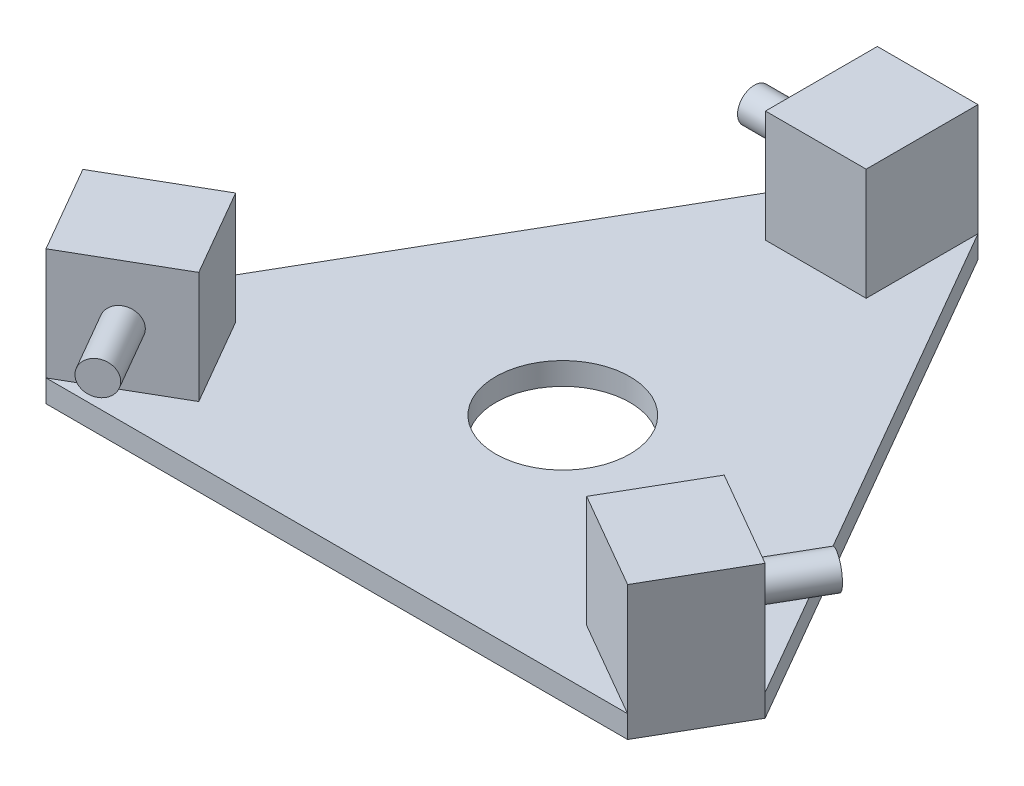
ISO-10303-21;
HEADER;
FILE_DESCRIPTION(('STEP AP214'),'2;1');
FILE_NAME('part.step','',(''),(''),'','','');
FILE_SCHEMA(('AUTOMOTIVE_DESIGN { 1 0 10303 214 1 1 1 1 }'));
ENDSEC;
DATA;
#1=APPLICATION_CONTEXT('core data for automotive mechanical design processes');
#2=APPLICATION_PROTOCOL_DEFINITION('international standard','automotive_design',2000,#1);
#3=PRODUCT_CONTEXT('',#1,'mechanical');
#4=PRODUCT('Part','Part','',(#3));
#5=PRODUCT_RELATED_PRODUCT_CATEGORY('part','',(#4));
#6=PRODUCT_DEFINITION_FORMATION('','',#4);
#7=PRODUCT_DEFINITION_CONTEXT('part definition',#1,'design');
#8=PRODUCT_DEFINITION('design','',#6,#7);
#9=PRODUCT_DEFINITION_SHAPE('','',#8);
#10=(LENGTH_UNIT() NAMED_UNIT(*) SI_UNIT(.MILLI.,.METRE.));
#11=(NAMED_UNIT(*) PLANE_ANGLE_UNIT() SI_UNIT($,.RADIAN.));
#12=(NAMED_UNIT(*) SI_UNIT($,.STERADIAN.) SOLID_ANGLE_UNIT());
#13=UNCERTAINTY_MEASURE_WITH_UNIT(LENGTH_MEASURE(1.E-05),#10,'distance_accuracy_value','');
#14=(GEOMETRIC_REPRESENTATION_CONTEXT(3) GLOBAL_UNCERTAINTY_ASSIGNED_CONTEXT((#13)) GLOBAL_UNIT_ASSIGNED_CONTEXT((#10,
#11,#12)) REPRESENTATION_CONTEXT('',''));
#15=CARTESIAN_POINT('',(0.,0.,0.));
#16=DIRECTION('',(0.,0.,1.));
#17=DIRECTION('',(1.,0.,0.));
#18=AXIS2_PLACEMENT_3D('',#15,#16,#17);
#19=CARTESIAN_POINT('',(0.,10.,0.));
#20=DIRECTION('',(0.,1.,0.));
#21=DIRECTION('',(0.,0.,1.));
#22=AXIS2_PLACEMENT_3D('',#19,#20,#21);
#23=PLANE('',#22);
#24=CARTESIAN_POINT('',(0.,10.,0.));
#25=DIRECTION('',(0.,1.,0.));
#26=DIRECTION('',(0.,0.,1.));
#27=AXIS2_PLACEMENT_3D('',#24,#25,#26);
#28=CIRCLE('',#27,30.);
#29=CARTESIAN_POINT('',(0.,10.,30.));
#30=VERTEX_POINT('',#29);
#31=EDGE_CURVE('E240',#30,#30,#28,.T.);
#32=ORIENTED_EDGE('',*,*,#31,.F.);
#33=EDGE_LOOP('',(#32));
#34=FACE_BOUND('',#33,.T.);
#35=DIRECTION('',(1.,0.,0.));
#36=VECTOR('',#35,1.);
#37=CARTESIAN_POINT('',(-130.,10.,101.036297108185));
#38=LINE('',#37,#36);
#39=CARTESIAN_POINT('',(-130.,10.,101.036297108185));
#40=VERTEX_POINT('',#39);
#41=CARTESIAN_POINT('',(130.,10.,101.036297108185));
#42=VERTEX_POINT('',#41);
#43=EDGE_CURVE('E248',#40,#42,#38,.T.);
#44=ORIENTED_EDGE('',*,*,#43,.T.);
#45=DIRECTION('',(0.866025403784439,0.,0.5));
#46=VECTOR('',#45,1.);
#47=CARTESIAN_POINT('',(86.698729810778,10.,76.0362971081845));
#48=LINE('',#47,#46);
#49=CARTESIAN_POINT('',(86.698729810778,10.,76.0362971081845));
#50=VERTEX_POINT('',#49);
#51=EDGE_CURVE('E61',#50,#42,#48,.T.);
#52=ORIENTED_EDGE('',*,*,#51,.F.);
#53=DIRECTION('',(-0.5,0.,0.866025403784439));
#54=VECTOR('',#53,1.);
#55=CARTESIAN_POINT('',(86.698729810778,10.,76.0362971081845));
#56=LINE('',#55,#54);
#57=CARTESIAN_POINT('',(109.198729810778,10.,37.0651539378848));
#58=VERTEX_POINT('',#57);
#59=EDGE_CURVE('E66',#58,#50,#56,.T.);
#60=ORIENTED_EDGE('',*,*,#59,.F.);
#61=DIRECTION('',(-0.866025403784439,0.,-0.5));
#62=VECTOR('',#61,1.);
#63=CARTESIAN_POINT('',(109.198729810778,10.,37.0651539378848));
#64=LINE('',#63,#62);
#65=CARTESIAN_POINT('',(152.5,10.,62.0651539378848));
#66=VERTEX_POINT('',#65);
#67=EDGE_CURVE('E171',#66,#58,#64,.T.);
#68=ORIENTED_EDGE('',*,*,#67,.F.);
#69=DIRECTION('',(-0.5,0.,-0.866025403784439));
#70=VECTOR('',#69,1.);
#71=CARTESIAN_POINT('',(152.5,10.,62.0651539378848));
#72=LINE('',#71,#70);
#73=CARTESIAN_POINT('',(22.5,10.,-163.101451046069));
#74=VERTEX_POINT('',#73);
#75=EDGE_CURVE('E251',#66,#74,#72,.T.);
#76=ORIENTED_EDGE('',*,*,#75,.T.);
#77=DIRECTION('',(0.,0.,-1.));
#78=VECTOR('',#77,1.);
#79=CARTESIAN_POINT('',(22.5,10.,-113.101451046069));
#80=LINE('',#79,#78);
#81=CARTESIAN_POINT('',(22.5,10.,-113.101451046069));
#82=VERTEX_POINT('',#81);
#83=EDGE_CURVE('E223',#82,#74,#80,.T.);
#84=ORIENTED_EDGE('',*,*,#83,.F.);
#85=DIRECTION('',(1.,0.,0.));
#86=VECTOR('',#85,1.);
#87=CARTESIAN_POINT('',(-22.5,10.,-113.101451046069));
#88=LINE('',#87,#86);
#89=CARTESIAN_POINT('',(-22.5,10.,-113.101451046069));
#90=VERTEX_POINT('',#89);
#91=EDGE_CURVE('E209',#90,#82,#88,.T.);
#92=ORIENTED_EDGE('',*,*,#91,.F.);
#93=DIRECTION('',(0.,0.,1.));
#94=VECTOR('',#93,1.);
#95=CARTESIAN_POINT('',(-22.5,10.,-113.101451046069));
#96=LINE('',#95,#94);
#97=CARTESIAN_POINT('',(-22.5,10.,-163.101451046069));
#98=VERTEX_POINT('',#97);
#99=EDGE_CURVE('E214',#98,#90,#96,.T.);
#100=ORIENTED_EDGE('',*,*,#99,.F.);
#101=DIRECTION('',(-0.5,0.,0.866025403784439));
#102=VECTOR('',#101,1.);
#103=CARTESIAN_POINT('',(-22.5,10.,-163.101451046069));
#104=LINE('',#103,#102);
#105=CARTESIAN_POINT('',(-152.5,10.,62.0651539378848));
#106=VERTEX_POINT('',#105);
#107=EDGE_CURVE('E246',#98,#106,#104,.T.);
#108=ORIENTED_EDGE('',*,*,#107,.T.);
#109=DIRECTION('',(-0.866025403784438,0.,0.500000000000001));
#110=VECTOR('',#109,1.);
#111=CARTESIAN_POINT('',(-109.198729810778,10.,37.0651539378848));
#112=LINE('',#111,#110);
#113=CARTESIAN_POINT('',(-109.198729810778,10.,37.0651539378848));
#114=VERTEX_POINT('',#113);
#115=EDGE_CURVE('E177',#114,#106,#112,.T.);
#116=ORIENTED_EDGE('',*,*,#115,.F.);
#117=DIRECTION('',(-0.500000000000001,0.,-0.866025403784438));
#118=VECTOR('',#117,1.);
#119=CARTESIAN_POINT('',(-86.6987298107781,10.,76.0362971081845));
#120=LINE('',#119,#118);
#121=CARTESIAN_POINT('',(-86.6987298107781,10.,76.0362971081845));
#122=VERTEX_POINT('',#121);
#123=EDGE_CURVE('E174',#122,#114,#120,.T.);
#124=ORIENTED_EDGE('',*,*,#123,.F.);
#125=DIRECTION('',(0.866025403784438,0.,-0.500000000000001));
#126=VECTOR('',#125,1.);
#127=CARTESIAN_POINT('',(-86.6987298107781,10.,76.0362971081845));
#128=LINE('',#127,#126);
#129=EDGE_CURVE('E187',#40,#122,#128,.T.);
#130=ORIENTED_EDGE('',*,*,#129,.F.);
#131=EDGE_LOOP('',(#44,#52,#60,#68,#76,#84,#92,#100,#108,#116,#124,#130));
#132=FACE_BOUND('',#131,.T.);
#133=ADVANCED_FACE('F46',(#34,#132),#23,.T.);
#134=CARTESIAN_POINT('',(0.,0.,0.));
#135=DIRECTION('',(0.,1.,0.));
#136=DIRECTION('',(0.,0.,1.));
#137=AXIS2_PLACEMENT_3D('',#134,#135,#136);
#138=PLANE('',#137);
#139=DIRECTION('',(-0.5,0.,0.866025403784439));
#140=VECTOR('',#139,1.);
#141=CARTESIAN_POINT('',(-22.5,0.,-163.101451046069));
#142=LINE('',#141,#140);
#143=CARTESIAN_POINT('',(-22.5,0.,-163.101451046069));
#144=VERTEX_POINT('',#143);
#145=CARTESIAN_POINT('',(-152.5,0.,62.0651539378848));
#146=VERTEX_POINT('',#145);
#147=EDGE_CURVE('E243',#144,#146,#142,.T.);
#148=ORIENTED_EDGE('',*,*,#147,.F.);
#149=DIRECTION('',(-1.,0.,0.));
#150=VECTOR('',#149,1.);
#151=CARTESIAN_POINT('',(22.5,0.,-163.101451046069));
#152=LINE('',#151,#150);
#153=CARTESIAN_POINT('',(22.5,0.,-163.101451046069));
#154=VERTEX_POINT('',#153);
#155=EDGE_CURVE('E249',#154,#144,#152,.T.);
#156=ORIENTED_EDGE('',*,*,#155,.F.);
#157=DIRECTION('',(-0.5,0.,-0.866025403784439));
#158=VECTOR('',#157,1.);
#159=CARTESIAN_POINT('',(152.5,0.,62.0651539378848));
#160=LINE('',#159,#158);
#161=CARTESIAN_POINT('',(152.5,0.,62.0651539378848));
#162=VERTEX_POINT('',#161);
#163=EDGE_CURVE('E263',#162,#154,#160,.T.);
#164=ORIENTED_EDGE('',*,*,#163,.F.);
#165=DIRECTION('',(0.5,0.,-0.866025403784439));
#166=VECTOR('',#165,1.);
#167=CARTESIAN_POINT('',(130.,0.,101.036297108185));
#168=LINE('',#167,#166);
#169=CARTESIAN_POINT('',(130.,0.,101.036297108185));
#170=VERTEX_POINT('',#169);
#171=EDGE_CURVE('E261',#170,#162,#168,.T.);
#172=ORIENTED_EDGE('',*,*,#171,.F.);
#173=DIRECTION('',(1.,0.,0.));
#174=VECTOR('',#173,1.);
#175=CARTESIAN_POINT('',(-130.,0.,101.036297108185));
#176=LINE('',#175,#174);
#177=CARTESIAN_POINT('',(-130.,0.,101.036297108185));
#178=VERTEX_POINT('',#177);
#179=EDGE_CURVE('E259',#178,#170,#176,.T.);
#180=ORIENTED_EDGE('',*,*,#179,.F.);
#181=DIRECTION('',(0.500000000000001,0.,0.866025403784438));
#182=VECTOR('',#181,1.);
#183=CARTESIAN_POINT('',(-152.5,0.,62.0651539378848));
#184=LINE('',#183,#182);
#185=EDGE_CURVE('E257',#146,#178,#184,.T.);
#186=ORIENTED_EDGE('',*,*,#185,.F.);
#187=EDGE_LOOP('',(#148,#156,#164,#172,#180,#186));
#188=FACE_BOUND('',#187,.T.);
#189=CARTESIAN_POINT('',(0.,0.,0.));
#190=DIRECTION('',(0.,1.,0.));
#191=DIRECTION('',(0.,0.,1.));
#192=AXIS2_PLACEMENT_3D('',#189,#190,#191);
#193=CIRCLE('',#192,30.);
#194=CARTESIAN_POINT('',(0.,0.,30.));
#195=VERTEX_POINT('',#194);
#196=EDGE_CURVE('E239',#195,#195,#193,.T.);
#197=ORIENTED_EDGE('',*,*,#196,.T.);
#198=EDGE_LOOP('',(#197));
#199=FACE_BOUND('',#198,.T.);
#200=ADVANCED_FACE('F288',(#188,#199),#138,.F.);
#201=CARTESIAN_POINT('',(-22.5,10.,-163.101451046069));
#202=DIRECTION('',(0.866025403784439,0.,0.5));
#203=DIRECTION('',(0.5,0.,-0.866025403784439));
#204=AXIS2_PLACEMENT_3D('',#201,#202,#203);
#205=PLANE('',#204);
#206=ORIENTED_EDGE('',*,*,#147,.T.);
#207=DIRECTION('',(0.,-1.,0.));
#208=VECTOR('',#207,1.);
#209=CARTESIAN_POINT('',(-152.5,10.,62.0651539378848));
#210=LINE('',#209,#208);
#211=EDGE_CURVE('E13',#106,#146,#210,.T.);
#212=ORIENTED_EDGE('',*,*,#211,.F.);
#213=ORIENTED_EDGE('',*,*,#107,.F.);
#214=DIRECTION('',(0.,-1.,0.));
#215=VECTOR('',#214,1.);
#216=CARTESIAN_POINT('',(-22.5,10.,-163.101451046069));
#217=LINE('',#216,#215);
#218=EDGE_CURVE('E254',#98,#144,#217,.T.);
#219=ORIENTED_EDGE('',*,*,#218,.T.);
#220=EDGE_LOOP('',(#206,#212,#213,#219));
#221=FACE_BOUND('',#220,.T.);
#222=ADVANCED_FACE('F48',(#221),#205,.F.);
#223=CARTESIAN_POINT('',(-152.5,10.,62.0651539378848));
#224=DIRECTION('',(0.866025403784438,0.,-0.500000000000001));
#225=DIRECTION('',(-0.500000000000001,0.,-0.866025403784438));
#226=AXIS2_PLACEMENT_3D('',#223,#224,#225);
#227=PLANE('',#226);
#228=ORIENTED_EDGE('',*,*,#185,.T.);
#229=DIRECTION('',(0.,-1.,0.));
#230=VECTOR('',#229,1.);
#231=CARTESIAN_POINT('',(-130.,10.,101.036297108185));
#232=LINE('',#231,#230);
#233=EDGE_CURVE('E54',#40,#178,#232,.T.);
#234=ORIENTED_EDGE('',*,*,#233,.F.);
#235=DIRECTION('',(0.,-1.,0.));
#236=VECTOR('',#235,1.);
#237=CARTESIAN_POINT('',(-130.,60.,101.036297108185));
#238=LINE('',#237,#236);
#239=CARTESIAN_POINT('',(-130.,60.,101.036297108185));
#240=VERTEX_POINT('',#239);
#241=EDGE_CURVE('E200',#240,#40,#238,.T.);
#242=ORIENTED_EDGE('',*,*,#241,.F.);
#243=DIRECTION('',(0.500000000000001,0.,0.866025403784438));
#244=VECTOR('',#243,1.);
#245=CARTESIAN_POINT('',(-130.,60.,101.036297108185));
#246=LINE('',#245,#244);
#247=CARTESIAN_POINT('',(-152.5,60.,62.0651539378848));
#248=VERTEX_POINT('',#247);
#249=EDGE_CURVE('E189',#248,#240,#246,.T.);
#250=ORIENTED_EDGE('',*,*,#249,.F.);
#251=DIRECTION('',(0.,-1.,0.));
#252=VECTOR('',#251,1.);
#253=CARTESIAN_POINT('',(-152.5,60.,62.0651539378848));
#254=LINE('',#253,#252);
#255=EDGE_CURVE('E203',#248,#106,#254,.T.);
#256=ORIENTED_EDGE('',*,*,#255,.T.);
#257=ORIENTED_EDGE('',*,*,#211,.T.);
#258=EDGE_LOOP('',(#228,#234,#242,#250,#256,#257));
#259=FACE_BOUND('',#258,.T.);
#260=ADVANCED_FACE('F347',(#259),#227,.F.);
#261=CARTESIAN_POINT('',(-130.,10.,101.036297108185));
#262=DIRECTION('',(0.,0.,-1.));
#263=DIRECTION('',(-1.,0.,0.));
#264=AXIS2_PLACEMENT_3D('',#261,#262,#263);
#265=PLANE('',#264);
#266=ORIENTED_EDGE('',*,*,#179,.T.);
#267=DIRECTION('',(0.,-1.,0.));
#268=VECTOR('',#267,1.);
#269=CARTESIAN_POINT('',(130.,10.,101.036297108185));
#270=LINE('',#269,#268);
#271=EDGE_CURVE('E274',#42,#170,#270,.T.);
#272=ORIENTED_EDGE('',*,*,#271,.F.);
#273=ORIENTED_EDGE('',*,*,#43,.F.);
#274=ORIENTED_EDGE('',*,*,#233,.T.);
#275=EDGE_LOOP('',(#266,#272,#273,#274));
#276=FACE_BOUND('',#275,.T.);
#277=ADVANCED_FACE('F280',(#276),#265,.F.);
#278=CARTESIAN_POINT('',(130.,10.,101.036297108185));
#279=DIRECTION('',(-0.866025403784439,0.,-0.5));
#280=DIRECTION('',(-0.5,0.,0.866025403784439));
#281=AXIS2_PLACEMENT_3D('',#278,#279,#280);
#282=PLANE('',#281);
#283=ORIENTED_EDGE('',*,*,#171,.T.);
#284=DIRECTION('',(0.,-1.,0.));
#285=VECTOR('',#284,1.);
#286=CARTESIAN_POINT('',(152.5,10.,62.0651539378848));
#287=LINE('',#286,#285);
#288=EDGE_CURVE('E271',#66,#162,#287,.T.);
#289=ORIENTED_EDGE('',*,*,#288,.F.);
#290=DIRECTION('',(0.,-1.,0.));
#291=VECTOR('',#290,1.);
#292=CARTESIAN_POINT('',(152.5,60.,62.0651539378848));
#293=LINE('',#292,#291);
#294=CARTESIAN_POINT('',(152.5,60.,62.0651539378848));
#295=VERTEX_POINT('',#294);
#296=EDGE_CURVE('E179',#295,#66,#293,.T.);
#297=ORIENTED_EDGE('',*,*,#296,.F.);
#298=DIRECTION('',(0.5,0.,-0.866025403784439));
#299=VECTOR('',#298,1.);
#300=CARTESIAN_POINT('',(130.,60.,101.036297108185));
#301=LINE('',#300,#299);
#302=CARTESIAN_POINT('',(130.,60.,101.036297108185));
#303=VERTEX_POINT('',#302);
#304=EDGE_CURVE('E161',#303,#295,#301,.T.);
#305=ORIENTED_EDGE('',*,*,#304,.F.);
#306=DIRECTION('',(0.,-1.,0.));
#307=VECTOR('',#306,1.);
#308=CARTESIAN_POINT('',(130.,60.,101.036297108185));
#309=LINE('',#308,#307);
#310=EDGE_CURVE('E158',#303,#42,#309,.T.);
#311=ORIENTED_EDGE('',*,*,#310,.T.);
#312=ORIENTED_EDGE('',*,*,#271,.T.);
#313=EDGE_LOOP('',(#283,#289,#297,#305,#311,#312));
#314=FACE_BOUND('',#313,.T.);
#315=ADVANCED_FACE('F294',(#314),#282,.F.);
#316=CARTESIAN_POINT('',(152.5,10.,62.0651539378848));
#317=DIRECTION('',(-0.866025403784439,0.,0.5));
#318=DIRECTION('',(0.5,0.,0.866025403784439));
#319=AXIS2_PLACEMENT_3D('',#316,#317,#318);
#320=PLANE('',#319);
#321=ORIENTED_EDGE('',*,*,#163,.T.);
#322=DIRECTION('',(0.,-1.,0.));
#323=VECTOR('',#322,1.);
#324=CARTESIAN_POINT('',(22.5,10.,-163.101451046069));
#325=LINE('',#324,#323);
#326=EDGE_CURVE('E268',#74,#154,#325,.T.);
#327=ORIENTED_EDGE('',*,*,#326,.F.);
#328=ORIENTED_EDGE('',*,*,#75,.F.);
#329=ORIENTED_EDGE('',*,*,#288,.T.);
#330=EDGE_LOOP('',(#321,#327,#328,#329));
#331=FACE_BOUND('',#330,.T.);
#332=ADVANCED_FACE('F297',(#331),#320,.F.);
#333=CARTESIAN_POINT('',(22.5,10.,-163.101451046069));
#334=DIRECTION('',(0.,0.,1.));
#335=DIRECTION('',(1.,0.,0.));
#336=AXIS2_PLACEMENT_3D('',#333,#334,#335);
#337=PLANE('',#336);
#338=ORIENTED_EDGE('',*,*,#155,.T.);
#339=ORIENTED_EDGE('',*,*,#218,.F.);
#340=DIRECTION('',(0.,-1.,0.));
#341=VECTOR('',#340,1.);
#342=CARTESIAN_POINT('',(-22.5,60.,-163.101451046069));
#343=LINE('',#342,#341);
#344=CARTESIAN_POINT('',(-22.5,60.,-163.101451046069));
#345=VERTEX_POINT('',#344);
#346=EDGE_CURVE('E230',#345,#98,#343,.T.);
#347=ORIENTED_EDGE('',*,*,#346,.F.);
#348=DIRECTION('',(-1.,0.,0.));
#349=VECTOR('',#348,1.);
#350=CARTESIAN_POINT('',(-22.5,60.,-163.101451046069));
#351=LINE('',#350,#349);
#352=CARTESIAN_POINT('',(22.5,60.,-163.101451046069));
#353=VERTEX_POINT('',#352);
#354=EDGE_CURVE('E216',#353,#345,#351,.T.);
#355=ORIENTED_EDGE('',*,*,#354,.F.);
#356=DIRECTION('',(0.,-1.,0.));
#357=VECTOR('',#356,1.);
#358=CARTESIAN_POINT('',(22.5,60.,-163.101451046069));
#359=LINE('',#358,#357);
#360=EDGE_CURVE('E233',#353,#74,#359,.T.);
#361=ORIENTED_EDGE('',*,*,#360,.T.);
#362=ORIENTED_EDGE('',*,*,#326,.T.);
#363=EDGE_LOOP('',(#338,#339,#347,#355,#361,#362));
#364=FACE_BOUND('',#363,.T.);
#365=ADVANCED_FACE('F305',(#364),#337,.F.);
#366=CARTESIAN_POINT('',(0.,10.,0.));
#367=DIRECTION('',(0.,-1.,0.));
#368=DIRECTION('',(0.,0.,-1.));
#369=AXIS2_PLACEMENT_3D('',#366,#367,#368);
#370=CYLINDRICAL_SURFACE('',#369,30.);
#371=ORIENTED_EDGE('',*,*,#31,.T.);
#372=EDGE_LOOP('',(#371));
#373=FACE_BOUND('',#372,.T.);
#374=ORIENTED_EDGE('',*,*,#196,.F.);
#375=EDGE_LOOP('',(#374));
#376=FACE_BOUND('',#375,.T.);
#377=ADVANCED_FACE('F337',(#373,#376),#370,.F.);
#378=CARTESIAN_POINT('',(-22.5,60.,-113.101451046069));
#379=DIRECTION('',(0.,0.,-1.));
#380=DIRECTION('',(-1.,0.,0.));
#381=AXIS2_PLACEMENT_3D('',#378,#379,#380);
#382=PLANE('',#381);
#383=ORIENTED_EDGE('',*,*,#91,.T.);
#384=DIRECTION('',(0.,-1.,0.));
#385=VECTOR('',#384,1.);
#386=CARTESIAN_POINT('',(22.5,60.,-113.101451046069));
#387=LINE('',#386,#385);
#388=CARTESIAN_POINT('',(22.5,60.,-113.101451046069));
#389=VERTEX_POINT('',#388);
#390=EDGE_CURVE('E236',#389,#82,#387,.T.);
#391=ORIENTED_EDGE('',*,*,#390,.F.);
#392=DIRECTION('',(1.,0.,0.));
#393=VECTOR('',#392,1.);
#394=CARTESIAN_POINT('',(-22.5,60.,-113.101451046069));
#395=LINE('',#394,#393);
#396=CARTESIAN_POINT('',(-22.5,60.,-113.101451046069));
#397=VERTEX_POINT('',#396);
#398=EDGE_CURVE('E210',#397,#389,#395,.T.);
#399=ORIENTED_EDGE('',*,*,#398,.F.);
#400=DIRECTION('',(0.,-1.,0.));
#401=VECTOR('',#400,1.);
#402=CARTESIAN_POINT('',(-22.5,60.,-113.101451046069));
#403=LINE('',#402,#401);
#404=EDGE_CURVE('E220',#397,#90,#403,.T.);
#405=ORIENTED_EDGE('',*,*,#404,.T.);
#406=EDGE_LOOP('',(#383,#391,#399,#405));
#407=FACE_BOUND('',#406,.T.);
#408=ADVANCED_FACE('F314',(#407),#382,.F.);
#409=CARTESIAN_POINT('',(22.5,60.,-113.101451046069));
#410=DIRECTION('',(-1.,0.,0.));
#411=DIRECTION('',(0.,0.,1.));
#412=AXIS2_PLACEMENT_3D('',#409,#410,#411);
#413=PLANE('',#412);
#414=ORIENTED_EDGE('',*,*,#83,.T.);
#415=ORIENTED_EDGE('',*,*,#360,.F.);
#416=DIRECTION('',(0.,0.,-1.));
#417=VECTOR('',#416,1.);
#418=CARTESIAN_POINT('',(22.5,60.,-113.101451046069));
#419=LINE('',#418,#417);
#420=EDGE_CURVE('E213',#389,#353,#419,.T.);
#421=ORIENTED_EDGE('',*,*,#420,.F.);
#422=ORIENTED_EDGE('',*,*,#390,.T.);
#423=EDGE_LOOP('',(#414,#415,#421,#422));
#424=FACE_BOUND('',#423,.T.);
#425=ADVANCED_FACE('F301',(#424),#413,.F.);
#426=CARTESIAN_POINT('',(-22.5,60.,-113.101451046069));
#427=DIRECTION('',(1.,0.,0.));
#428=DIRECTION('',(0.,0.,-1.));
#429=AXIS2_PLACEMENT_3D('',#426,#427,#428);
#430=PLANE('',#429);
#431=CARTESIAN_POINT('',(-22.5,35.,-138.101451046069));
#432=DIRECTION('',(1.,0.,0.));
#433=DIRECTION('',(0.,0.,-1.));
#434=AXIS2_PLACEMENT_3D('',#431,#432,#433);
#435=CIRCLE('',#434,7.49999999999999);
#436=CARTESIAN_POINT('',(-22.5,35.,-145.601451046069));
#437=VERTEX_POINT('',#436);
#438=EDGE_CURVE('E509',#437,#437,#435,.T.);
#439=ORIENTED_EDGE('',*,*,#438,.T.);
#440=EDGE_LOOP('',(#439));
#441=FACE_BOUND('',#440,.T.);
#442=ORIENTED_EDGE('',*,*,#99,.T.);
#443=ORIENTED_EDGE('',*,*,#404,.F.);
#444=DIRECTION('',(0.,0.,1.));
#445=VECTOR('',#444,1.);
#446=CARTESIAN_POINT('',(-22.5,60.,-113.101451046069));
#447=LINE('',#446,#445);
#448=EDGE_CURVE('E218',#345,#397,#447,.T.);
#449=ORIENTED_EDGE('',*,*,#448,.F.);
#450=ORIENTED_EDGE('',*,*,#346,.T.);
#451=EDGE_LOOP('',(#442,#443,#449,#450));
#452=FACE_BOUND('',#451,.T.);
#453=ADVANCED_FACE('F316',(#441,#452),#430,.F.);
#454=CARTESIAN_POINT('',(0.,60.,0.));
#455=DIRECTION('',(0.,1.,0.));
#456=DIRECTION('',(0.,0.,1.));
#457=AXIS2_PLACEMENT_3D('',#454,#455,#456);
#458=PLANE('',#457);
#459=ORIENTED_EDGE('',*,*,#398,.T.);
#460=ORIENTED_EDGE('',*,*,#420,.T.);
#461=ORIENTED_EDGE('',*,*,#354,.T.);
#462=ORIENTED_EDGE('',*,*,#448,.T.);
#463=EDGE_LOOP('',(#459,#460,#461,#462));
#464=FACE_BOUND('',#463,.T.);
#465=ADVANCED_FACE('F310',(#464),#458,.T.);
#466=CARTESIAN_POINT('',(-86.6987298107781,60.,76.0362971081845));
#467=DIRECTION('',(-0.866025403784438,0.,0.500000000000001));
#468=DIRECTION('',(0.500000000000001,0.,0.866025403784438));
#469=AXIS2_PLACEMENT_3D('',#466,#467,#468);
#470=PLANE('',#469);
#471=ORIENTED_EDGE('',*,*,#123,.T.);
#472=DIRECTION('',(0.,-1.,0.));
#473=VECTOR('',#472,1.);
#474=CARTESIAN_POINT('',(-109.198729810778,60.,37.0651539378848));
#475=LINE('',#474,#473);
#476=CARTESIAN_POINT('',(-109.198729810778,60.,37.0651539378848));
#477=VERTEX_POINT('',#476);
#478=EDGE_CURVE('E206',#477,#114,#475,.T.);
#479=ORIENTED_EDGE('',*,*,#478,.F.);
#480=DIRECTION('',(-0.500000000000001,0.,-0.866025403784438));
#481=VECTOR('',#480,1.);
#482=CARTESIAN_POINT('',(-86.6987298107781,60.,76.0362971081845));
#483=LINE('',#482,#481);
#484=CARTESIAN_POINT('',(-86.6987298107781,60.,76.0362971081845));
#485=VERTEX_POINT('',#484);
#486=EDGE_CURVE('E183',#485,#477,#483,.T.);
#487=ORIENTED_EDGE('',*,*,#486,.F.);
#488=DIRECTION('',(0.,-1.,0.));
#489=VECTOR('',#488,1.);
#490=CARTESIAN_POINT('',(-86.6987298107781,60.,76.0362971081845));
#491=LINE('',#490,#489);
#492=EDGE_CURVE('E192',#485,#122,#491,.T.);
#493=ORIENTED_EDGE('',*,*,#492,.T.);
#494=EDGE_LOOP('',(#471,#479,#487,#493));
#495=FACE_BOUND('',#494,.T.);
#496=ADVANCED_FACE('F324',(#495),#470,.F.);
#497=CARTESIAN_POINT('',(-109.198729810778,60.,37.0651539378848));
#498=DIRECTION('',(0.500000000000001,0.,0.866025403784438));
#499=DIRECTION('',(0.866025403784438,0.,-0.500000000000001));
#500=AXIS2_PLACEMENT_3D('',#497,#498,#499);
#501=PLANE('',#500);
#502=ORIENTED_EDGE('',*,*,#115,.T.);
#503=ORIENTED_EDGE('',*,*,#255,.F.);
#504=DIRECTION('',(-0.866025403784438,0.,0.500000000000001));
#505=VECTOR('',#504,1.);
#506=CARTESIAN_POINT('',(-109.198729810778,60.,37.0651539378848));
#507=LINE('',#506,#505);
#508=EDGE_CURVE('E186',#477,#248,#507,.T.);
#509=ORIENTED_EDGE('',*,*,#508,.F.);
#510=ORIENTED_EDGE('',*,*,#478,.T.);
#511=EDGE_LOOP('',(#502,#503,#509,#510));
#512=FACE_BOUND('',#511,.T.);
#513=ADVANCED_FACE('F359',(#512),#501,.F.);
#514=CARTESIAN_POINT('',(-86.6987298107781,60.,76.0362971081845));
#515=DIRECTION('',(-0.500000000000001,0.,-0.866025403784438));
#516=DIRECTION('',(-0.866025403784438,0.,0.500000000000001));
#517=AXIS2_PLACEMENT_3D('',#514,#515,#516);
#518=PLANE('',#517);
#519=CARTESIAN_POINT('',(-108.349364905389,35.,88.5362971081845));
#520=DIRECTION('',(-0.500000000000001,0.,-0.866025403784438));
#521=DIRECTION('',(-0.866025403784438,0.,0.500000000000001));
#522=AXIS2_PLACEMENT_3D('',#519,#520,#521);
#523=CIRCLE('',#522,7.5);
#524=CARTESIAN_POINT('',(-114.844555433772,35.,92.2862971081845));
#525=VERTEX_POINT('',#524);
#526=EDGE_CURVE('E519',#525,#525,#523,.T.);
#527=ORIENTED_EDGE('',*,*,#526,.T.);
#528=EDGE_LOOP('',(#527));
#529=FACE_BOUND('',#528,.T.);
#530=ORIENTED_EDGE('',*,*,#129,.T.);
#531=ORIENTED_EDGE('',*,*,#492,.F.);
#532=DIRECTION('',(0.866025403784438,0.,-0.500000000000001));
#533=VECTOR('',#532,1.);
#534=CARTESIAN_POINT('',(-86.6987298107781,60.,76.0362971081845));
#535=LINE('',#534,#533);
#536=EDGE_CURVE('E191',#240,#485,#535,.T.);
#537=ORIENTED_EDGE('',*,*,#536,.F.);
#538=ORIENTED_EDGE('',*,*,#241,.T.);
#539=EDGE_LOOP('',(#530,#531,#537,#538));
#540=FACE_BOUND('',#539,.T.);
#541=ADVANCED_FACE('F365',(#529,#540),#518,.F.);
#542=CARTESIAN_POINT('',(0.,60.,0.));
#543=DIRECTION('',(0.,1.,0.));
#544=DIRECTION('',(0.,0.,1.));
#545=AXIS2_PLACEMENT_3D('',#542,#543,#544);
#546=PLANE('',#545);
#547=ORIENTED_EDGE('',*,*,#486,.T.);
#548=ORIENTED_EDGE('',*,*,#508,.T.);
#549=ORIENTED_EDGE('',*,*,#249,.T.);
#550=ORIENTED_EDGE('',*,*,#536,.T.);
#551=EDGE_LOOP('',(#547,#548,#549,#550));
#552=FACE_BOUND('',#551,.T.);
#553=ADVANCED_FACE('F391',(#552),#546,.T.);
#554=CARTESIAN_POINT('',(86.698729810778,60.,76.0362971081845));
#555=DIRECTION('',(0.866025403784439,0.,0.5));
#556=DIRECTION('',(0.5,0.,-0.866025403784439));
#557=AXIS2_PLACEMENT_3D('',#554,#555,#556);
#558=PLANE('',#557);
#559=ORIENTED_EDGE('',*,*,#59,.T.);
#560=DIRECTION('',(0.,-1.,0.));
#561=VECTOR('',#560,1.);
#562=CARTESIAN_POINT('',(86.698729810778,60.,76.0362971081845));
#563=LINE('',#562,#561);
#564=CARTESIAN_POINT('',(86.698729810778,60.,76.0362971081845));
#565=VERTEX_POINT('',#564);
#566=EDGE_CURVE('E156',#565,#50,#563,.T.);
#567=ORIENTED_EDGE('',*,*,#566,.F.);
#568=DIRECTION('',(-0.5,0.,0.866025403784439));
#569=VECTOR('',#568,1.);
#570=CARTESIAN_POINT('',(86.698729810778,60.,76.0362971081845));
#571=LINE('',#570,#569);
#572=CARTESIAN_POINT('',(109.198729810778,60.,37.0651539378848));
#573=VERTEX_POINT('',#572);
#574=EDGE_CURVE('E162',#573,#565,#571,.T.);
#575=ORIENTED_EDGE('',*,*,#574,.F.);
#576=DIRECTION('',(0.,-1.,0.));
#577=VECTOR('',#576,1.);
#578=CARTESIAN_POINT('',(109.198729810778,60.,37.0651539378848));
#579=LINE('',#578,#577);
#580=EDGE_CURVE('E368',#573,#58,#579,.T.);
#581=ORIENTED_EDGE('',*,*,#580,.T.);
#582=EDGE_LOOP('',(#559,#567,#575,#581));
#583=FACE_BOUND('',#582,.T.);
#584=ADVANCED_FACE('F173',(#583),#558,.F.);
#585=CARTESIAN_POINT('',(86.698729810778,60.,76.0362971081845));
#586=DIRECTION('',(0.5,0.,-0.866025403784439));
#587=DIRECTION('',(-0.866025403784439,0.,-0.5));
#588=AXIS2_PLACEMENT_3D('',#585,#586,#587);
#589=PLANE('',#588);
#590=ORIENTED_EDGE('',*,*,#51,.T.);
#591=ORIENTED_EDGE('',*,*,#310,.F.);
#592=DIRECTION('',(0.866025403784439,0.,0.5));
#593=VECTOR('',#592,1.);
#594=CARTESIAN_POINT('',(86.698729810778,60.,76.0362971081845));
#595=LINE('',#594,#593);
#596=EDGE_CURVE('E152',#565,#303,#595,.T.);
#597=ORIENTED_EDGE('',*,*,#596,.F.);
#598=ORIENTED_EDGE('',*,*,#566,.T.);
#599=EDGE_LOOP('',(#590,#591,#597,#598));
#600=FACE_BOUND('',#599,.T.);
#601=ADVANCED_FACE('F154',(#600),#589,.F.);
#602=CARTESIAN_POINT('',(109.198729810778,60.,37.0651539378848));
#603=DIRECTION('',(-0.5,0.,0.866025403784439));
#604=DIRECTION('',(0.866025403784439,0.,0.5));
#605=AXIS2_PLACEMENT_3D('',#602,#603,#604);
#606=PLANE('',#605);
#607=CARTESIAN_POINT('',(130.849364905389,35.,49.5651539378848));
#608=DIRECTION('',(-0.5,0.,0.866025403784439));
#609=DIRECTION('',(0.866025403784439,0.,0.5));
#610=AXIS2_PLACEMENT_3D('',#607,#608,#609);
#611=CIRCLE('',#610,7.50000000000002);
#612=CARTESIAN_POINT('',(137.344555433772,35.,53.3151539378848));
#613=VERTEX_POINT('',#612);
#614=EDGE_CURVE('E514',#613,#613,#611,.T.);
#615=ORIENTED_EDGE('',*,*,#614,.T.);
#616=EDGE_LOOP('',(#615));
#617=FACE_BOUND('',#616,.T.);
#618=ORIENTED_EDGE('',*,*,#67,.T.);
#619=ORIENTED_EDGE('',*,*,#580,.F.);
#620=DIRECTION('',(-0.866025403784439,0.,-0.5));
#621=VECTOR('',#620,1.);
#622=CARTESIAN_POINT('',(109.198729810778,60.,37.0651539378848));
#623=LINE('',#622,#621);
#624=EDGE_CURVE('E167',#295,#573,#623,.T.);
#625=ORIENTED_EDGE('',*,*,#624,.F.);
#626=ORIENTED_EDGE('',*,*,#296,.T.);
#627=EDGE_LOOP('',(#618,#619,#625,#626));
#628=FACE_BOUND('',#627,.T.);
#629=ADVANCED_FACE('F375',(#617,#628),#606,.F.);
#630=CARTESIAN_POINT('',(0.,60.,0.));
#631=DIRECTION('',(0.,-1.,0.));
#632=DIRECTION('',(0.,0.,-1.));
#633=AXIS2_PLACEMENT_3D('',#630,#631,#632);
#634=PLANE('',#633);
#635=ORIENTED_EDGE('',*,*,#574,.T.);
#636=ORIENTED_EDGE('',*,*,#596,.T.);
#637=ORIENTED_EDGE('',*,*,#304,.T.);
#638=ORIENTED_EDGE('',*,*,#624,.T.);
#639=EDGE_LOOP('',(#635,#636,#637,#638));
#640=FACE_BOUND('',#639,.T.);
#641=ADVANCED_FACE('F165',(#640),#634,.F.);
#642=CARTESIAN_POINT('',(-52.5,35.,-138.101451046069));
#643=DIRECTION('',(1.,0.,0.));
#644=DIRECTION('',(0.,0.,-1.));
#645=AXIS2_PLACEMENT_3D('',#642,#643,#644);
#646=CYLINDRICAL_SURFACE('',#645,7.49999999999999);
#647=CARTESIAN_POINT('',(-52.5,35.,-138.101451046069));
#648=DIRECTION('',(1.,0.,0.));
#649=DIRECTION('',(0.,0.,-1.));
#650=AXIS2_PLACEMENT_3D('',#647,#648,#649);
#651=CIRCLE('',#650,7.49999999999999);
#652=CARTESIAN_POINT('',(-52.5,35.,-145.601451046069));
#653=VERTEX_POINT('',#652);
#654=EDGE_CURVE('E371',#653,#653,#651,.T.);
#655=ORIENTED_EDGE('',*,*,#654,.T.);
#656=EDGE_LOOP('',(#655));
#657=FACE_BOUND('',#656,.T.);
#658=ORIENTED_EDGE('',*,*,#438,.F.);
#659=EDGE_LOOP('',(#658));
#660=FACE_BOUND('',#659,.T.);
#661=ADVANCED_FACE('F383',(#657,#660),#646,.T.);
#662=CARTESIAN_POINT('',(-52.5,35.,-138.101451046069));
#663=DIRECTION('',(1.,0.,0.));
#664=DIRECTION('',(0.,0.,-1.));
#665=AXIS2_PLACEMENT_3D('',#662,#663,#664);
#666=PLANE('',#665);
#667=ORIENTED_EDGE('',*,*,#654,.F.);
#668=EDGE_LOOP('',(#667));
#669=FACE_BOUND('',#668,.T.);
#670=ADVANCED_FACE('F449',(#669),#666,.F.);
#671=CARTESIAN_POINT('',(145.849364905389,35.,23.5843918243516));
#672=DIRECTION('',(-0.5,0.,0.866025403784439));
#673=DIRECTION('',(0.866025403784439,0.,0.5));
#674=AXIS2_PLACEMENT_3D('',#671,#672,#673);
#675=CYLINDRICAL_SURFACE('',#674,7.50000000000002);
#676=CARTESIAN_POINT('',(145.849364905389,35.,23.5843918243516));
#677=DIRECTION('',(-0.5,0.,0.866025403784439));
#678=DIRECTION('',(0.866025403784439,0.,0.5));
#679=AXIS2_PLACEMENT_3D('',#676,#677,#678);
#680=CIRCLE('',#679,7.50000000000002);
#681=CARTESIAN_POINT('',(152.344555433772,35.,27.3343918243516));
#682=VERTEX_POINT('',#681);
#683=EDGE_CURVE('E510',#682,#682,#680,.T.);
#684=ORIENTED_EDGE('',*,*,#683,.T.);
#685=EDGE_LOOP('',(#684));
#686=FACE_BOUND('',#685,.T.);
#687=ORIENTED_EDGE('',*,*,#614,.F.);
#688=EDGE_LOOP('',(#687));
#689=FACE_BOUND('',#688,.T.);
#690=ADVANCED_FACE('F454',(#686,#689),#675,.T.);
#691=CARTESIAN_POINT('',(145.849364905389,35.,23.5843918243516));
#692=DIRECTION('',(-0.5,0.,0.866025403784439));
#693=DIRECTION('',(0.866025403784439,0.,0.5));
#694=AXIS2_PLACEMENT_3D('',#691,#692,#693);
#695=PLANE('',#694);
#696=ORIENTED_EDGE('',*,*,#683,.F.);
#697=EDGE_LOOP('',(#696));
#698=FACE_BOUND('',#697,.T.);
#699=ADVANCED_FACE('F459',(#698),#695,.F.);
#700=CARTESIAN_POINT('',(-93.3493649053891,35.,114.517059221718));
#701=DIRECTION('',(-0.500000000000001,0.,-0.866025403784438));
#702=DIRECTION('',(-0.866025403784438,0.,0.500000000000001));
#703=AXIS2_PLACEMENT_3D('',#700,#701,#702);
#704=CYLINDRICAL_SURFACE('',#703,7.5);
#705=CARTESIAN_POINT('',(-93.3493649053891,35.,114.517059221718));
#706=DIRECTION('',(-0.500000000000001,0.,-0.866025403784438));
#707=DIRECTION('',(-0.866025403784438,0.,0.500000000000001));
#708=AXIS2_PLACEMENT_3D('',#705,#706,#707);
#709=CIRCLE('',#708,7.5);
#710=CARTESIAN_POINT('',(-99.8445554337724,35.,118.267059221718));
#711=VERTEX_POINT('',#710);
#712=EDGE_CURVE('E517',#711,#711,#709,.T.);
#713=ORIENTED_EDGE('',*,*,#712,.T.);
#714=EDGE_LOOP('',(#713));
#715=FACE_BOUND('',#714,.T.);
#716=ORIENTED_EDGE('',*,*,#526,.F.);
#717=EDGE_LOOP('',(#716));
#718=FACE_BOUND('',#717,.T.);
#719=ADVANCED_FACE('F468',(#715,#718),#704,.T.);
#720=CARTESIAN_POINT('',(-93.3493649053891,35.,114.517059221718));
#721=DIRECTION('',(-0.500000000000001,0.,-0.866025403784438));
#722=DIRECTION('',(-0.866025403784438,0.,0.500000000000001));
#723=AXIS2_PLACEMENT_3D('',#720,#721,#722);
#724=PLANE('',#723);
#725=ORIENTED_EDGE('',*,*,#712,.F.);
#726=EDGE_LOOP('',(#725));
#727=FACE_BOUND('',#726,.T.);
#728=ADVANCED_FACE('F485',(#727),#724,.F.);
#729=CLOSED_SHELL('',(#133,#200,#222,#260,#277,#315,#332,#365,#377,#408,#425,#453,#465,#496,
#513,#541,#553,#584,#601,#629,#641,#661,#670,#690,#699,#719,#728));
#730=MANIFOLD_SOLID_BREP('B2',#729);
#731=ADVANCED_BREP_SHAPE_REPRESENTATION('',(#18,#730),#14);
#732=SHAPE_DEFINITION_REPRESENTATION(#9,#731);
ENDSEC;
END-ISO-10303-21;
